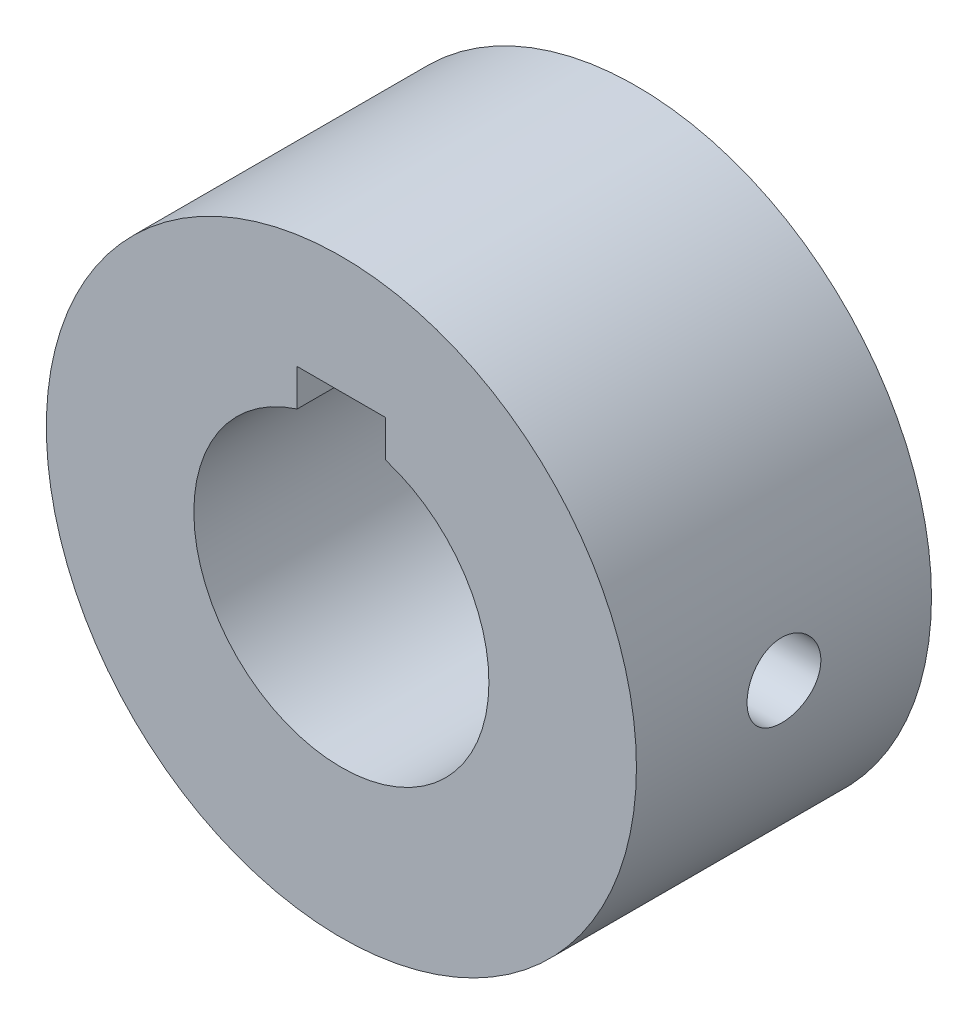
ISO-10303-21;
HEADER;
FILE_DESCRIPTION(('STEP AP214'),'2;1');
FILE_NAME('part.step','',(''),(''),'','','');
FILE_SCHEMA(('AUTOMOTIVE_DESIGN { 1 0 10303 214 1 1 1 1 }'));
ENDSEC;
DATA;
#1=APPLICATION_CONTEXT('core data for automotive mechanical design processes');
#2=APPLICATION_PROTOCOL_DEFINITION('international standard','automotive_design',2000,#1);
#3=PRODUCT_CONTEXT('',#1,'mechanical');
#4=PRODUCT('Part','Part','',(#3));
#5=PRODUCT_RELATED_PRODUCT_CATEGORY('part','',(#4));
#6=PRODUCT_DEFINITION_FORMATION('','',#4);
#7=PRODUCT_DEFINITION_CONTEXT('part definition',#1,'design');
#8=PRODUCT_DEFINITION('design','',#6,#7);
#9=PRODUCT_DEFINITION_SHAPE('','',#8);
#10=(LENGTH_UNIT() NAMED_UNIT(*) SI_UNIT(.MILLI.,.METRE.));
#11=(NAMED_UNIT(*) PLANE_ANGLE_UNIT() SI_UNIT($,.RADIAN.));
#12=(NAMED_UNIT(*) SI_UNIT($,.STERADIAN.) SOLID_ANGLE_UNIT());
#13=UNCERTAINTY_MEASURE_WITH_UNIT(LENGTH_MEASURE(1.E-05),#10,'distance_accuracy_value','');
#14=(GEOMETRIC_REPRESENTATION_CONTEXT(3) GLOBAL_UNCERTAINTY_ASSIGNED_CONTEXT((#13)) GLOBAL_UNIT_ASSIGNED_CONTEXT((#10,
#11,#12)) REPRESENTATION_CONTEXT('',''));
#15=CARTESIAN_POINT('',(0.,0.,0.));
#16=DIRECTION('',(0.,0.,1.));
#17=DIRECTION('',(1.,0.,0.));
#18=AXIS2_PLACEMENT_3D('',#15,#16,#17);
#19=CARTESIAN_POINT('',(0.,0.,20.));
#20=DIRECTION('',(0.,0.,-1.));
#21=DIRECTION('',(-1.,0.,0.));
#22=AXIS2_PLACEMENT_3D('',#19,#20,#21);
#23=CYLINDRICAL_SURFACE('',#22,20.);
#24=CARTESIAN_POINT('',(19.8377246816478,2.54257339228189,10.));
#25=CARTESIAN_POINT('',(19.8377267028832,2.54256745143874,9.86016371619954));
#26=CARTESIAN_POINT('',(19.8392440556379,2.53080452445764,9.7202400350694));
#27=CARTESIAN_POINT('',(19.8451493195851,2.48406560299587,9.44428677457154));
#28=CARTESIAN_POINT('',(19.849540230332,2.44906535175303,9.30826141949822));
#29=CARTESIAN_POINT('',(19.8606940575121,2.35689894504537,9.04414011789239));
#30=CARTESIAN_POINT('',(19.8674553637481,2.29974783376824,8.9160388578836));
#31=CARTESIAN_POINT('',(19.8825965230411,2.16493300673544,8.67127154817467));
#32=CARTESIAN_POINT('',(19.8909760993362,2.08727279768022,8.55460354825634));
#33=CARTESIAN_POINT('',(19.9084761543771,1.9131772111633,8.33533775287848));
#34=CARTESIAN_POINT('',(19.9176001269615,1.81664993180256,8.23281319768128));
#35=CARTESIAN_POINT('',(19.9355483210854,1.60775640954183,8.04537723106077));
#36=CARTESIAN_POINT('',(19.9443725276937,1.49538937910774,7.96046669590527));
#37=CARTESIAN_POINT('',(19.9607819772309,1.25754431934708,7.81040642049368));
#38=CARTESIAN_POINT('',(19.9683630265877,1.13202416257901,7.74532295490036));
#39=CARTESIAN_POINT('',(19.9814178352314,0.871724598654322,7.63718880005903));
#40=CARTESIAN_POINT('',(19.9868916727277,0.736945535361648,7.59413729307349));
#41=CARTESIAN_POINT('',(19.9951148597644,0.462702017597996,7.53150793166558));
#42=CARTESIAN_POINT('',(19.9978783278995,0.323265798314571,7.51180832147611));
#43=CARTESIAN_POINT('',(20.0004443877133,0.0430400004193912,7.49606461496346));
#44=CARTESIAN_POINT('',(20.0002470958704,-0.0977495247345229,7.50001958804746));
#45=CARTESIAN_POINT('',(19.9969490238187,-0.375856933935684,7.53137520275743));
#46=CARTESIAN_POINT('',(19.9938644507141,-0.513189805731882,7.55864489848138));
#47=CARTESIAN_POINT('',(19.9851831159944,-0.781320009461581,7.63565117662994));
#48=CARTESIAN_POINT('',(19.9795863066207,-0.912117217097087,7.68538818616684));
#49=CARTESIAN_POINT('',(19.9665059574743,-1.16386761890817,7.80605649278379));
#50=CARTESIAN_POINT('',(19.9590173815533,-1.28479337859737,7.87704445773019));
#51=CARTESIAN_POINT('',(19.9430123245899,-1.51306747204577,8.03815836221604));
#52=CARTESIAN_POINT('',(19.934495796413,-1.62041518275148,8.12828517946858));
#53=CARTESIAN_POINT('',(19.9173382609156,-1.819253846497,8.32585181859839));
#54=CARTESIAN_POINT('',(19.908696800651,-1.91063140882603,8.43340575954667));
#55=CARTESIAN_POINT('',(19.8923369921158,-2.07405290035508,8.66238155678246));
#56=CARTESIAN_POINT('',(19.8846186467388,-2.14609676895268,8.78380345653806));
#57=CARTESIAN_POINT('',(19.8709921588922,-2.26881087315857,9.03716949556233));
#58=CARTESIAN_POINT('',(19.865084786299,-2.31947202203588,9.16911807995321));
#59=CARTESIAN_POINT('',(19.855773479535,-2.39788090723922,9.43973945352684));
#60=CARTESIAN_POINT('',(19.8523694247169,-2.42562974783204,9.57841191830873));
#61=CARTESIAN_POINT('',(19.8484773737362,-2.45727547730974,9.85754318199977));
#62=CARTESIAN_POINT('',(19.8479698635556,-2.46133198574725,9.9979836230888));
#63=CARTESIAN_POINT('',(19.8498774887459,-2.44589896809156,10.2775419296654));
#64=CARTESIAN_POINT('',(19.8522925618222,-2.42640994386982,10.4166598232793));
#65=CARTESIAN_POINT('',(19.8597518788733,-2.36457392509039,10.6891457635779));
#66=CARTESIAN_POINT('',(19.8647872307758,-2.32230422093079,10.8225316151904));
#67=CARTESIAN_POINT('',(19.8769049268946,-2.21618720999872,11.0803241548532));
#68=CARTESIAN_POINT('',(19.8839873430291,-2.15233914511355,11.2047305272409));
#69=CARTESIAN_POINT('',(19.8994363282664,-2.0044866780635,11.441754643813));
#70=CARTESIAN_POINT('',(19.9078094812174,-1.92037761484371,11.5543066653144));
#71=CARTESIAN_POINT('',(19.9248602210847,-1.73454022253793,11.763756553935));
#72=CARTESIAN_POINT('',(19.9335378198323,-1.63281120811182,11.860653811868));
#73=CARTESIAN_POINT('',(19.9502608010058,-1.41392601336489,12.0366041873344));
#74=CARTESIAN_POINT('',(19.9583022979299,-1.29668520466869,12.115552446795));
#75=CARTESIAN_POINT('',(19.9727712992701,-1.0505176801054,12.2526382176338));
#76=CARTESIAN_POINT('',(19.9791988362177,-0.921591199849332,12.310776148481));
#77=CARTESIAN_POINT('',(19.9896766959106,-0.656061774058642,12.404417786908));
#78=CARTESIAN_POINT('',(19.9937333811433,-0.519480462209006,12.4399820960316));
#79=CARTESIAN_POINT('',(19.9990133690668,-0.242232984963526,12.4876640892267));
#80=CARTESIAN_POINT('',(20.0002367995267,-0.101567004060232,12.4997828305992));
#81=CARTESIAN_POINT('',(19.9996885866161,0.178832673910677,12.5002099222922));
#82=CARTESIAN_POINT('',(19.9979372957095,0.318566192078852,12.488679960568));
#83=CARTESIAN_POINT('',(19.991649652203,0.594086938175877,12.4424793865691));
#84=CARTESIAN_POINT('',(19.9871133015401,0.729874168849198,12.4078087903882));
#85=CARTESIAN_POINT('',(19.9757387272027,0.993627418072707,12.3163618856504));
#86=CARTESIAN_POINT('',(19.9689013099777,1.12159615821165,12.259593320627));
#87=CARTESIAN_POINT('',(19.9536588113375,1.36621279119297,12.1255786853922));
#88=CARTESIAN_POINT('',(19.9452537112857,1.48286054942684,12.0483323717374));
#89=CARTESIAN_POINT('',(19.9277249329369,1.7023513472823,11.8749567846645));
#90=CARTESIAN_POINT('',(19.9185969107503,1.80509901690448,11.7787072064796));
#91=CARTESIAN_POINT('',(19.900670747751,1.9930483148564,11.5703070559679));
#92=CARTESIAN_POINT('',(19.8918726855911,2.07824578120618,11.4581527224968));
#93=CARTESIAN_POINT('',(19.8755509990365,2.2289590800227,11.220630077313));
#94=CARTESIAN_POINT('',(19.8680324272978,2.29439763805536,11.0952124101068));
#95=CARTESIAN_POINT('',(19.8551675437006,2.40319578840313,10.8351432594475));
#96=CARTESIAN_POINT('',(19.8498188705523,2.44657939406564,10.7005020007077));
#97=CARTESIAN_POINT('',(19.8431898320838,2.49965091675678,10.4709700129508));
#98=CARTESIAN_POINT('',(19.8411504854648,2.51572371252607,10.3775270484603));
#99=CARTESIAN_POINT('',(19.838417230785,2.53718692184929,10.1894027500352));
#100=CARTESIAN_POINT('',(19.8377233125161,2.542577416453,10.0947214255021));
#101=CARTESIAN_POINT('',(19.8377246816478,2.54257339228189,10.));
#102=B_SPLINE_CURVE_WITH_KNOTS('',3,(#24,#25,#26,#27,#28,#29,#30,#31,#32,#33,#34,#35,#36,#37,
#38,#39,#40,#41,#42,#43,#44,#45,#46,#47,#48,#49,#50,#51,#52,#53,#54,#55,#56,#57,#58,#59,#60,#61,
#62,#63,#64,#65,#66,#67,#68,#69,#70,#71,#72,#73,#74,#75,#76,#77,#78,#79,#80,#81,#82,#83,#84,#85,
#86,#87,#88,#89,#90,#91,#92,#93,#94,#95,#96,#97,#98,#99,#100,#101),.UNSPECIFIED.,.T.,.F.,(4,2,2,
2,2,2,2,2,2,2,2,2,2,2,2,2,2,2,2,2,2,2,2,2,2,2,2,2,2,2,2,2,2,2,2,2,2,2,4),(0.,0.419162817491659,
0.838763876176505,1.25808045260532,1.67732537953025,2.09866577551478,2.52002712744991,
2.94278186148153,3.36552090342242,3.78604596943869,4.2065544917252,4.6247166493545,
5.04288675674201,5.46218204415216,5.88149656471516,6.30367697380181,6.72585870621836,
7.1482196674142,7.57056027158599,7.99005217808294,8.40953514329526,8.82760376295144,
9.24568707214264,9.66597819546522,10.0862856699722,10.5089888589475,10.9316835271129,
11.3532385678735,11.7747745977522,12.1934381629066,12.612101436892,13.030618135465,
13.4491398096666,13.8704012889324,14.2917625544224,14.7147509770793,15.1372778598593,
15.4212098963686,15.7051397785939),.UNSPECIFIED.);
#103=CARTESIAN_POINT('',(19.8377246816478,2.54257339228189,10.));
#104=VERTEX_POINT('',#103);
#105=EDGE_CURVE('E115',#104,#104,#102,.T.);
#106=ORIENTED_EDGE('',*,*,#105,.T.);
#107=EDGE_LOOP('',(#106));
#108=FACE_BOUND('',#107,.T.);
#109=CARTESIAN_POINT('',(0.,0.,20.));
#110=DIRECTION('',(0.,0.,1.));
#111=DIRECTION('',(1.,0.,0.));
#112=AXIS2_PLACEMENT_3D('',#109,#110,#111);
#113=CIRCLE('',#112,20.);
#114=CARTESIAN_POINT('',(20.,0.,20.));
#115=VERTEX_POINT('',#114);
#116=EDGE_CURVE('E112',#115,#115,#113,.T.);
#117=ORIENTED_EDGE('',*,*,#116,.F.);
#118=EDGE_LOOP('',(#117));
#119=FACE_BOUND('',#118,.T.);
#120=CARTESIAN_POINT('',(0.,0.,0.));
#121=DIRECTION('',(0.,0.,1.));
#122=DIRECTION('',(1.,0.,0.));
#123=AXIS2_PLACEMENT_3D('',#120,#121,#122);
#124=CIRCLE('',#123,20.);
#125=CARTESIAN_POINT('',(20.,0.,0.));
#126=VERTEX_POINT('',#125);
#127=EDGE_CURVE('E111',#126,#126,#124,.T.);
#128=ORIENTED_EDGE('',*,*,#127,.T.);
#129=EDGE_LOOP('',(#128));
#130=FACE_BOUND('',#129,.T.);
#131=ADVANCED_FACE('F39',(#108,#119,#130),#23,.T.);
#132=CARTESIAN_POINT('',(0.,0.,20.));
#133=DIRECTION('',(0.,0.,1.));
#134=DIRECTION('',(1.,0.,0.));
#135=AXIS2_PLACEMENT_3D('',#132,#133,#134);
#136=PLANE('',#135);
#137=CARTESIAN_POINT('',(0.,0.,20.));
#138=DIRECTION('',(0.,0.,1.));
#139=DIRECTION('',(1.,0.,0.));
#140=AXIS2_PLACEMENT_3D('',#137,#138,#139);
#141=CIRCLE('',#140,10.);
#142=CARTESIAN_POINT('',(-3.,9.53939201416946,20.));
#143=VERTEX_POINT('',#142);
#144=CARTESIAN_POINT('',(3.,9.53939201416946,20.));
#145=VERTEX_POINT('',#144);
#146=EDGE_CURVE('E54',#143,#145,#141,.T.);
#147=ORIENTED_EDGE('',*,*,#146,.F.);
#148=DIRECTION('',(0.,-1.,0.));
#149=VECTOR('',#148,1.);
#150=CARTESIAN_POINT('',(-3.,9.53939201416946,20.));
#151=LINE('',#150,#149);
#152=CARTESIAN_POINT('',(-3.,12.0393920141695,20.));
#153=VERTEX_POINT('',#152);
#154=EDGE_CURVE('E98',#153,#143,#151,.T.);
#155=ORIENTED_EDGE('',*,*,#154,.F.);
#156=DIRECTION('',(-1.,0.,0.));
#157=VECTOR('',#156,1.);
#158=CARTESIAN_POINT('',(3.,12.0393920141695,20.));
#159=LINE('',#158,#157);
#160=CARTESIAN_POINT('',(3.,12.0393920141695,20.));
#161=VERTEX_POINT('',#160);
#162=EDGE_CURVE('E83',#161,#153,#159,.T.);
#163=ORIENTED_EDGE('',*,*,#162,.F.);
#164=DIRECTION('',(0.,1.,0.));
#165=VECTOR('',#164,1.);
#166=CARTESIAN_POINT('',(3.,9.53939201416946,20.));
#167=LINE('',#166,#165);
#168=EDGE_CURVE('E91',#145,#161,#167,.T.);
#169=ORIENTED_EDGE('',*,*,#168,.F.);
#170=EDGE_LOOP('',(#147,#155,#163,#169));
#171=FACE_BOUND('',#170,.T.);
#172=ORIENTED_EDGE('',*,*,#116,.T.);
#173=EDGE_LOOP('',(#172));
#174=FACE_BOUND('',#173,.T.);
#175=ADVANCED_FACE('F95',(#171,#174),#136,.T.);
#176=CARTESIAN_POINT('',(0.,0.,0.));
#177=DIRECTION('',(0.,0.,1.));
#178=DIRECTION('',(1.,0.,0.));
#179=AXIS2_PLACEMENT_3D('',#176,#177,#178);
#180=PLANE('',#179);
#181=DIRECTION('',(0.,-1.,0.));
#182=VECTOR('',#181,1.);
#183=CARTESIAN_POINT('',(-3.,0.,0.));
#184=LINE('',#183,#182);
#185=CARTESIAN_POINT('',(-3.,12.0393920141695,0.));
#186=VERTEX_POINT('',#185);
#187=CARTESIAN_POINT('',(-3.,9.53939201416946,0.));
#188=VERTEX_POINT('',#187);
#189=EDGE_CURVE('E11',#186,#188,#184,.T.);
#190=ORIENTED_EDGE('',*,*,#189,.T.);
#191=CARTESIAN_POINT('',(0.,0.,0.));
#192=DIRECTION('',(0.,0.,1.));
#193=DIRECTION('',(1.,0.,0.));
#194=AXIS2_PLACEMENT_3D('',#191,#192,#193);
#195=CIRCLE('',#194,10.);
#196=CARTESIAN_POINT('',(3.,9.53939201416946,0.));
#197=VERTEX_POINT('',#196);
#198=EDGE_CURVE('E108',#188,#197,#195,.T.);
#199=ORIENTED_EDGE('',*,*,#198,.T.);
#200=DIRECTION('',(0.,1.,0.));
#201=VECTOR('',#200,1.);
#202=CARTESIAN_POINT('',(3.,0.,0.));
#203=LINE('',#202,#201);
#204=CARTESIAN_POINT('',(3.,12.0393920141695,0.));
#205=VERTEX_POINT('',#204);
#206=EDGE_CURVE('E123',#197,#205,#203,.T.);
#207=ORIENTED_EDGE('',*,*,#206,.T.);
#208=DIRECTION('',(-1.,0.,0.));
#209=VECTOR('',#208,1.);
#210=CARTESIAN_POINT('',(0.,12.0393920141695,0.));
#211=LINE('',#210,#209);
#212=EDGE_CURVE('E47',#205,#186,#211,.T.);
#213=ORIENTED_EDGE('',*,*,#212,.T.);
#214=EDGE_LOOP('',(#190,#199,#207,#213));
#215=FACE_BOUND('',#214,.T.);
#216=ORIENTED_EDGE('',*,*,#127,.F.);
#217=EDGE_LOOP('',(#216));
#218=FACE_BOUND('',#217,.T.);
#219=ADVANCED_FACE('F133',(#215,#218),#180,.F.);
#220=CARTESIAN_POINT('',(19.9999539559133,0.0429157470844367,10.));
#221=DIRECTION('',(0.999997697795665,0.00214578735422163,0.));
#222=DIRECTION('',(-0.00214578735422163,0.999997697795665,0.));
#223=AXIS2_PLACEMENT_3D('',#220,#221,#222);
#224=CYLINDRICAL_SURFACE('',#223,2.49999999999999);
#225=CARTESIAN_POINT('',(9.67707160613537,2.52077074120767,10.));
#226=CARTESIAN_POINT('',(9.67707424990386,2.52076682546469,9.86194924907343));
#227=CARTESIAN_POINT('',(9.68008091412874,2.50930341764023,9.72385510132148));
#228=CARTESIAN_POINT('',(9.69175408727865,2.46382524105365,9.45163242182649));
#229=CARTESIAN_POINT('',(9.70042389015255,2.42979734754617,9.31750624553182));
#230=CARTESIAN_POINT('',(9.72238771664402,2.34035876423134,9.05719646181282));
#231=CARTESIAN_POINT('',(9.73567576850437,2.28497567828426,8.93100284461429));
#232=CARTESIAN_POINT('',(9.76538134510798,2.15448053311529,8.68968914746012));
#233=CARTESIAN_POINT('',(9.78179900270622,2.07936763629141,8.57456953791978));
#234=CARTESIAN_POINT('',(9.81633178831317,1.90977658462402,8.35613835473779));
#235=CARTESIAN_POINT('',(9.83447413383842,1.81494375630724,8.25310639964996));
#236=CARTESIAN_POINT('',(9.87019812305267,1.60936511550411,8.06423860563967));
#237=CARTESIAN_POINT('',(9.88777971419272,1.49861781697678,7.97840437437826));
#238=CARTESIAN_POINT('',(9.92071807582454,1.26243585885616,7.82522453236873));
#239=CARTESIAN_POINT('',(9.93604037949213,1.13681782317939,7.75815361183854));
#240=CARTESIAN_POINT('',(9.96245211224846,0.875642503960232,7.64619035584692));
#241=CARTESIAN_POINT('',(9.97354216581443,0.740086690278929,7.60129474808449));
#242=CARTESIAN_POINT('',(9.99007108764346,0.465796399320294,7.53585216542142));
#243=CARTESIAN_POINT('',(9.99561988751701,0.327181947540916,7.51483035567342));
#244=CARTESIAN_POINT('',(10.0008553479338,0.0482886393700833,7.49624162072445));
#245=CARTESIAN_POINT('',(10.00054287517,-0.091989967880877,7.49867122779041));
#246=CARTESIAN_POINT('',(9.99419132494898,-0.36693605333199,7.52657485025015));
#247=CARTESIAN_POINT('',(9.98827947194327,-0.501658970142791,7.55153632505386));
#248=CARTESIAN_POINT('',(9.97157274296661,-0.76495050491302,7.62297127004851));
#249=CARTESIAN_POINT('',(9.96077760706068,-0.893518794861488,7.66944588537742));
#250=CARTESIAN_POINT('',(9.9353488890481,-1.14220024232696,7.78300257068707));
#251=CARTESIAN_POINT('',(9.92068150606382,-1.26222650739862,7.85026704466175));
#252=CARTESIAN_POINT('',(9.88911789620951,-1.48947254079526,8.00335567911627));
#253=CARTESIAN_POINT('',(9.8722212817709,-1.59669007603607,8.08918306856063));
#254=CARTESIAN_POINT('',(9.83751861945456,-1.79833000478497,8.27970874198237));
#255=CARTESIAN_POINT('',(9.81970033476956,-1.89232756541211,8.38485489234775));
#256=CARTESIAN_POINT('',(9.78559639240111,-2.06144787678945,8.60959997354029));
#257=CARTESIAN_POINT('',(9.76931080637356,-2.13656974534741,8.72919957949111));
#258=CARTESIAN_POINT('',(9.74008990785974,-2.26607537777175,8.98029003414887));
#259=CARTESIAN_POINT('',(9.72717122342395,-2.32035681835807,9.11183573031281));
#260=CARTESIAN_POINT('',(9.70637127969752,-2.40589178169808,9.38258546807685));
#261=CARTESIAN_POINT('',(9.69848894247936,-2.43715023227265,9.5217878639846));
#262=CARTESIAN_POINT('',(9.68888678623253,-2.47504504598296,9.79995950152992));
#263=CARTESIAN_POINT('',(9.68700970049308,-2.48230992578824,9.93883779334102));
#264=CARTESIAN_POINT('',(9.68920384240467,-2.47373171447352,10.2158219365853));
#265=CARTESIAN_POINT('',(9.69327452249217,-2.45789075052517,10.3539278579494));
#266=CARTESIAN_POINT('',(9.70675185924685,-2.40410237328301,10.6231142649486));
#267=CARTESIAN_POINT('',(9.71607012141642,-2.36652089609729,10.7542727265692));
#268=CARTESIAN_POINT('',(9.73890209805488,-2.27072569637898,11.0084314578533));
#269=CARTESIAN_POINT('',(9.75241630948926,-2.21250952977151,11.1314307590558));
#270=CARTESIAN_POINT('',(9.78243808407403,-2.07578441488221,11.3684412778669));
#271=CARTESIAN_POINT('',(9.79899916767198,-1.99689978260895,11.482228840043));
#272=CARTESIAN_POINT('',(9.83310213859113,-1.82155517970659,11.6951883628015));
#273=CARTESIAN_POINT('',(9.85064418676566,-1.72509232080171,11.7943579166501));
#274=CARTESIAN_POINT('',(9.88524647294144,-1.51444865215706,11.9778110425709));
#275=CARTESIAN_POINT('',(9.90228367303444,-1.39988490906657,12.0616600625488));
#276=CARTESIAN_POINT('',(9.93347973713842,-1.15794423735755,12.2089358669512));
#277=CARTESIAN_POINT('',(9.94763875127041,-1.03056797753519,12.2723637166082));
#278=CARTESIAN_POINT('',(9.97137100709102,-0.767500829460187,12.3764460345279));
#279=CARTESIAN_POINT('',(9.98097715397875,-0.631877852721846,12.4172642843791));
#280=CARTESIAN_POINT('',(9.9946386183897,-0.355428849909494,12.4754603346084));
#281=CARTESIAN_POINT('',(9.998695007165,-0.214603833359877,12.492842658739));
#282=CARTESIAN_POINT('',(10.0007395671727,0.0641684243332409,12.5034189739388));
#283=CARTESIAN_POINT('',(9.99888884819863,0.202090521915467,12.4972542727385));
#284=CARTESIAN_POINT('',(9.98965147072362,0.474855502050237,12.4623804317641));
#285=CARTESIAN_POINT('',(9.98226497686312,0.609698476056643,12.4336719624671));
#286=CARTESIAN_POINT('',(9.96278804395305,0.871807620788728,12.3548694505728));
#287=CARTESIAN_POINT('',(9.95072314211126,0.999110672492785,12.304891366714));
#288=CARTESIAN_POINT('',(9.92313659158839,1.2435884366112,12.1850735524511));
#289=CARTESIAN_POINT('',(9.9076145072096,1.36076186983603,12.1152313183238));
#290=CARTESIAN_POINT('',(9.87430355269331,1.58469662504882,11.9557119150097));
#291=CARTESIAN_POINT('',(9.8564692856368,1.69114125124895,11.8655996427404));
#292=CARTESIAN_POINT('',(9.82073841513791,1.88761511265978,11.6689428700566));
#293=CARTESIAN_POINT('',(9.80284179703888,1.97764017958679,11.5623942097221));
#294=CARTESIAN_POINT('',(9.76861660367484,2.14037136772822,11.3334964645263));
#295=CARTESIAN_POINT('',(9.75232351052356,2.21272305514471,11.2108896915869));
#296=CARTESIAN_POINT('',(9.7236093845841,2.3356874167482,10.9548612753129));
#297=CARTESIAN_POINT('',(9.71118553646675,2.38631590728586,10.8214475847654));
#298=CARTESIAN_POINT('',(9.69354813130559,2.45686227062417,10.5735574704121));
#299=CARTESIAN_POINT('',(9.68741566021809,2.48077577176371,10.4602670890347));
#300=CARTESIAN_POINT('',(9.67917646166602,2.51273097070028,10.2313278275058));
#301=CARTESIAN_POINT('',(9.6770693907987,2.52077402239096,10.115679149389));
#302=CARTESIAN_POINT('',(9.67707160613537,2.52077074120767,10.));
#303=B_SPLINE_CURVE_WITH_KNOTS('',3,(#225,#226,#227,#228,#229,#230,#231,#232,#233,#234,#235,
#236,#237,#238,#239,#240,#241,#242,#243,#244,#245,#246,#247,#248,#249,#250,#251,#252,#253,#254,
#255,#256,#257,#258,#259,#260,#261,#262,#263,#264,#265,#266,#267,#268,#269,#270,#271,#272,#273,
#274,#275,#276,#277,#278,#279,#280,#281,#282,#283,#284,#285,#286,#287,#288,#289,#290,#291,#292,
#293,#294,#295,#296,#297,#298,#299,#300,#301,#302),.UNSPECIFIED.,.T.,.F.,(4,2,2,2,2,2,2,2,2,2,2,
2,2,2,2,2,2,2,2,2,2,2,2,2,2,2,2,2,2,2,2,2,2,2,2,2,2,2,4),(0.,0.413727441736134,
0.827695741428665,1.24113072716602,1.65458326755478,2.07623954192976,2.49793521479866,
2.92551496397919,3.35303159847091,3.77188750995346,4.19068148666019,4.60018262688946,
5.00970556724785,5.42292874254443,5.83622385468912,6.2607046657191,6.685205311998,
7.11176432008401,7.53823200129546,7.95343574764202,8.36860127188745,8.7769740501415,
9.1853952142636,9.601828458641,10.0183301888999,10.4452533097026,10.872154157245,
11.2959207281187,11.7196054891398,12.131834461324,12.5440511738192,12.9540487656465,
13.3640980574301,13.7839709658701,14.2039503157045,14.6317647729113,15.0592672137501,
15.4059782718572,15.7526597510791),.UNSPECIFIED.);
#304=CARTESIAN_POINT('',(9.67707160613537,2.52077074120767,10.));
#305=VERTEX_POINT('',#304);
#306=EDGE_CURVE('E105',#305,#305,#303,.T.);
#307=ORIENTED_EDGE('',*,*,#306,.T.);
#308=EDGE_LOOP('',(#307));
#309=FACE_BOUND('',#308,.T.);
#310=ORIENTED_EDGE('',*,*,#105,.F.);
#311=EDGE_LOOP('',(#310));
#312=FACE_BOUND('',#311,.T.);
#313=ADVANCED_FACE('F128',(#309,#312),#224,.F.);
#314=CARTESIAN_POINT('',(-3.,9.53939201416946,-5.));
#315=DIRECTION('',(-1.,0.,0.));
#316=DIRECTION('',(0.,0.,1.));
#317=AXIS2_PLACEMENT_3D('',#314,#315,#316);
#318=PLANE('',#317);
#319=DIRECTION('',(0.,0.,1.));
#320=VECTOR('',#319,1.);
#321=CARTESIAN_POINT('',(-3.,12.0393920141695,-5.));
#322=LINE('',#321,#320);
#323=EDGE_CURVE('E87',#186,#153,#322,.T.);
#324=ORIENTED_EDGE('',*,*,#323,.T.);
#325=ORIENTED_EDGE('',*,*,#154,.T.);
#326=DIRECTION('',(0.,0.,1.));
#327=VECTOR('',#326,1.);
#328=CARTESIAN_POINT('',(-3.,9.53939201416946,-5.));
#329=LINE('',#328,#327);
#330=EDGE_CURVE('E103',#188,#143,#329,.T.);
#331=ORIENTED_EDGE('',*,*,#330,.F.);
#332=ORIENTED_EDGE('',*,*,#189,.F.);
#333=EDGE_LOOP('',(#324,#325,#331,#332));
#334=FACE_BOUND('',#333,.T.);
#335=ADVANCED_FACE('F132',(#334),#318,.F.);
#336=CARTESIAN_POINT('',(3.,12.0393920141695,-5.));
#337=DIRECTION('',(0.,1.,0.));
#338=DIRECTION('',(-1.,0.,0.));
#339=AXIS2_PLACEMENT_3D('',#336,#337,#338);
#340=PLANE('',#339);
#341=DIRECTION('',(0.,0.,1.));
#342=VECTOR('',#341,1.);
#343=CARTESIAN_POINT('',(3.,12.0393920141695,-5.));
#344=LINE('',#343,#342);
#345=EDGE_CURVE('E62',#205,#161,#344,.T.);
#346=ORIENTED_EDGE('',*,*,#345,.T.);
#347=ORIENTED_EDGE('',*,*,#162,.T.);
#348=ORIENTED_EDGE('',*,*,#323,.F.);
#349=ORIENTED_EDGE('',*,*,#212,.F.);
#350=EDGE_LOOP('',(#346,#347,#348,#349));
#351=FACE_BOUND('',#350,.T.);
#352=ADVANCED_FACE('F80',(#351),#340,.F.);
#353=CARTESIAN_POINT('',(3.,9.53939201416946,-5.));
#354=DIRECTION('',(1.,0.,0.));
#355=DIRECTION('',(0.,0.,-1.));
#356=AXIS2_PLACEMENT_3D('',#353,#354,#355);
#357=PLANE('',#356);
#358=DIRECTION('',(0.,0.,1.));
#359=VECTOR('',#358,1.);
#360=CARTESIAN_POINT('',(3.,9.53939201416946,-5.));
#361=LINE('',#360,#359);
#362=EDGE_CURVE('E88',#197,#145,#361,.T.);
#363=ORIENTED_EDGE('',*,*,#362,.T.);
#364=ORIENTED_EDGE('',*,*,#168,.T.);
#365=ORIENTED_EDGE('',*,*,#345,.F.);
#366=ORIENTED_EDGE('',*,*,#206,.F.);
#367=EDGE_LOOP('',(#363,#364,#365,#366));
#368=FACE_BOUND('',#367,.T.);
#369=ADVANCED_FACE('F92',(#368),#357,.F.);
#370=CARTESIAN_POINT('',(0.,0.,-5.));
#371=DIRECTION('',(0.,0.,1.));
#372=DIRECTION('',(1.,0.,0.));
#373=AXIS2_PLACEMENT_3D('',#370,#371,#372);
#374=CYLINDRICAL_SURFACE('',#373,10.);
#375=ORIENTED_EDGE('',*,*,#306,.F.);
#376=EDGE_LOOP('',(#375));
#377=FACE_BOUND('',#376,.T.);
#378=ORIENTED_EDGE('',*,*,#330,.T.);
#379=ORIENTED_EDGE('',*,*,#146,.T.);
#380=ORIENTED_EDGE('',*,*,#362,.F.);
#381=ORIENTED_EDGE('',*,*,#198,.F.);
#382=EDGE_LOOP('',(#378,#379,#380,#381));
#383=FACE_BOUND('',#382,.T.);
#384=ADVANCED_FACE('F135',(#377,#383),#374,.F.);
#385=CLOSED_SHELL('',(#131,#175,#219,#313,#335,#352,#369,#384));
#386=MANIFOLD_SOLID_BREP('B2',#385);
#387=ADVANCED_BREP_SHAPE_REPRESENTATION('',(#18,#386),#14);
#388=SHAPE_DEFINITION_REPRESENTATION(#9,#387);
ENDSEC;
END-ISO-10303-21;
